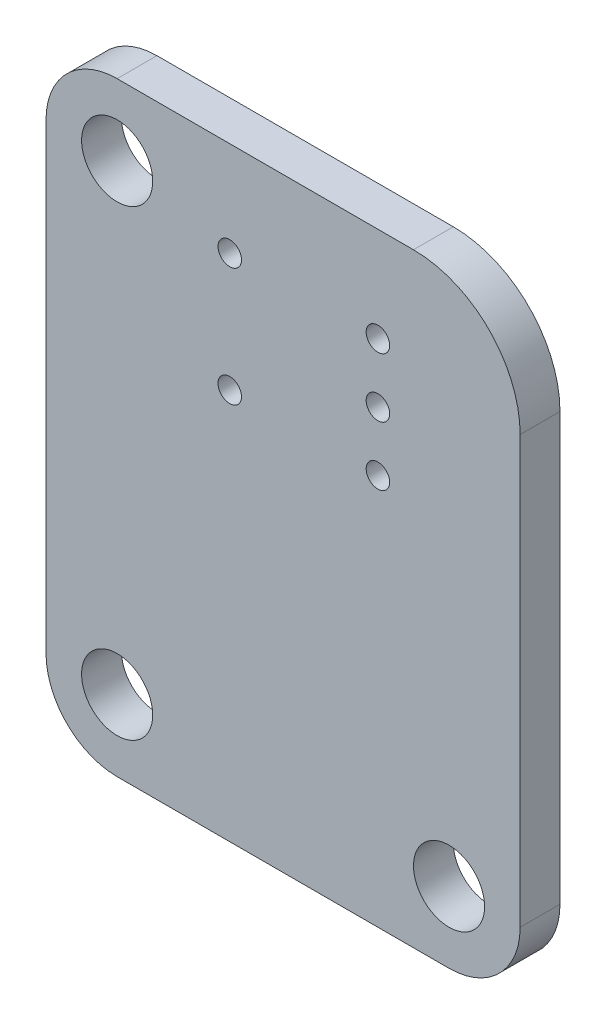
ISO-10303-21;
HEADER;
FILE_DESCRIPTION(('STEP AP214'),'2;1');
FILE_NAME('part.step','',(''),(''),'','','');
FILE_SCHEMA(('AUTOMOTIVE_DESIGN { 1 0 10303 214 1 1 1 1 }'));
ENDSEC;
DATA;
#1=APPLICATION_CONTEXT('core data for automotive mechanical design processes');
#2=APPLICATION_PROTOCOL_DEFINITION('international standard','automotive_design',2000,#1);
#3=PRODUCT_CONTEXT('',#1,'mechanical');
#4=PRODUCT('Part','Part','',(#3));
#5=PRODUCT_RELATED_PRODUCT_CATEGORY('part','',(#4));
#6=PRODUCT_DEFINITION_FORMATION('','',#4);
#7=PRODUCT_DEFINITION_CONTEXT('part definition',#1,'design');
#8=PRODUCT_DEFINITION('design','',#6,#7);
#9=PRODUCT_DEFINITION_SHAPE('','',#8);
#10=(LENGTH_UNIT() NAMED_UNIT(*) SI_UNIT(.MILLI.,.METRE.));
#11=(NAMED_UNIT(*) PLANE_ANGLE_UNIT() SI_UNIT($,.RADIAN.));
#12=(NAMED_UNIT(*) SI_UNIT($,.STERADIAN.) SOLID_ANGLE_UNIT());
#13=UNCERTAINTY_MEASURE_WITH_UNIT(LENGTH_MEASURE(1.E-05),#10,'distance_accuracy_value','');
#14=(GEOMETRIC_REPRESENTATION_CONTEXT(3) GLOBAL_UNCERTAINTY_ASSIGNED_CONTEXT((#13)) GLOBAL_UNIT_ASSIGNED_CONTEXT((#10,
#11,#12)) REPRESENTATION_CONTEXT('',''));
#15=CARTESIAN_POINT('',(0.,0.,0.));
#16=DIRECTION('',(0.,0.,1.));
#17=DIRECTION('',(1.,0.,0.));
#18=AXIS2_PLACEMENT_3D('',#15,#16,#17);
#19=CARTESIAN_POINT('',(95.5,60.5,-3.02000000000003));
#20=DIRECTION('',(0.,0.,-1.));
#21=DIRECTION('',(-1.,0.,0.));
#22=AXIS2_PLACEMENT_3D('',#19,#20,#21);
#23=CYLINDRICAL_SURFACE('',#22,4.50000000000003);
#24=CARTESIAN_POINT('',(95.5,60.5,-4.70000000000003));
#25=DIRECTION('',(0.,0.,1.));
#26=DIRECTION('',(1.,0.,0.));
#27=AXIS2_PLACEMENT_3D('',#24,#25,#26);
#28=CIRCLE('',#27,4.50000000000003);
#29=CARTESIAN_POINT('',(100.,60.5,-4.70000000000003));
#30=VERTEX_POINT('',#29);
#31=CARTESIAN_POINT('',(95.5,65.,-4.70000000000003));
#32=VERTEX_POINT('',#31);
#33=EDGE_CURVE('E129',#30,#32,#28,.T.);
#34=ORIENTED_EDGE('',*,*,#33,.T.);
#35=DIRECTION('',(0.,0.,-1.));
#36=VECTOR('',#35,1.);
#37=CARTESIAN_POINT('',(95.5,65.,-3.02000000000003));
#38=LINE('',#37,#36);
#39=CARTESIAN_POINT('',(95.5,65.,-3.02000000000003));
#40=VERTEX_POINT('',#39);
#41=EDGE_CURVE('E11',#40,#32,#38,.T.);
#42=ORIENTED_EDGE('',*,*,#41,.F.);
#43=CARTESIAN_POINT('',(95.5,60.5,-3.02000000000003));
#44=DIRECTION('',(0.,0.,1.));
#45=DIRECTION('',(1.,0.,0.));
#46=AXIS2_PLACEMENT_3D('',#43,#44,#45);
#47=CIRCLE('',#46,4.50000000000003);
#48=CARTESIAN_POINT('',(100.,60.5,-3.02000000000003));
#49=VERTEX_POINT('',#48);
#50=EDGE_CURVE('E144',#49,#40,#47,.T.);
#51=ORIENTED_EDGE('',*,*,#50,.F.);
#52=DIRECTION('',(0.,0.,-1.));
#53=VECTOR('',#52,1.);
#54=CARTESIAN_POINT('',(100.,60.5,-3.02000000000003));
#55=LINE('',#54,#53);
#56=EDGE_CURVE('E125',#49,#30,#55,.T.);
#57=ORIENTED_EDGE('',*,*,#56,.T.);
#58=EDGE_LOOP('',(#34,#42,#51,#57));
#59=FACE_BOUND('',#58,.T.);
#60=ADVANCED_FACE('F33',(#59),#23,.T.);
#61=CARTESIAN_POINT('',(95.5,65.,-3.02000000000003));
#62=DIRECTION('',(0.,-1.,0.));
#63=DIRECTION('',(1.,0.,0.));
#64=AXIS2_PLACEMENT_3D('',#61,#62,#63);
#65=PLANE('',#64);
#66=DIRECTION('',(-1.,0.,0.));
#67=VECTOR('',#66,1.);
#68=CARTESIAN_POINT('',(95.5,65.,-4.70000000000003));
#69=LINE('',#68,#67);
#70=CARTESIAN_POINT('',(83.,65.,-4.70000000000003));
#71=VERTEX_POINT('',#70);
#72=EDGE_CURVE('E132',#32,#71,#69,.T.);
#73=ORIENTED_EDGE('',*,*,#72,.T.);
#74=DIRECTION('',(0.,0.,-1.));
#75=VECTOR('',#74,1.);
#76=CARTESIAN_POINT('',(83.,65.,-3.02000000000003));
#77=LINE('',#76,#75);
#78=CARTESIAN_POINT('',(83.,65.,-3.02000000000003));
#79=VERTEX_POINT('',#78);
#80=EDGE_CURVE('E41',#79,#71,#77,.T.);
#81=ORIENTED_EDGE('',*,*,#80,.F.);
#82=DIRECTION('',(-1.,0.,0.));
#83=VECTOR('',#82,1.);
#84=CARTESIAN_POINT('',(95.5,65.,-3.02000000000003));
#85=LINE('',#84,#83);
#86=EDGE_CURVE('E92',#40,#79,#85,.T.);
#87=ORIENTED_EDGE('',*,*,#86,.F.);
#88=ORIENTED_EDGE('',*,*,#41,.T.);
#89=EDGE_LOOP('',(#73,#81,#87,#88));
#90=FACE_BOUND('',#89,.T.);
#91=ADVANCED_FACE('F239',(#90),#65,.F.);
#92=CARTESIAN_POINT('',(83.,62.,-3.02000000000003));
#93=DIRECTION('',(0.,0.,-1.));
#94=DIRECTION('',(-1.,0.,0.));
#95=AXIS2_PLACEMENT_3D('',#92,#93,#94);
#96=CYLINDRICAL_SURFACE('',#95,3.00000000000001);
#97=CARTESIAN_POINT('',(83.,62.,-4.70000000000003));
#98=DIRECTION('',(0.,0.,1.));
#99=DIRECTION('',(1.,0.,0.));
#100=AXIS2_PLACEMENT_3D('',#97,#98,#99);
#101=CIRCLE('',#100,3.00000000000001);
#102=CARTESIAN_POINT('',(80.,62.,-4.70000000000003));
#103=VERTEX_POINT('',#102);
#104=EDGE_CURVE('E135',#71,#103,#101,.T.);
#105=ORIENTED_EDGE('',*,*,#104,.T.);
#106=DIRECTION('',(0.,0.,-1.));
#107=VECTOR('',#106,1.);
#108=CARTESIAN_POINT('',(80.,62.,-3.02000000000003));
#109=LINE('',#108,#107);
#110=CARTESIAN_POINT('',(80.,62.,-3.02000000000003));
#111=VERTEX_POINT('',#110);
#112=EDGE_CURVE('E151',#111,#103,#109,.T.);
#113=ORIENTED_EDGE('',*,*,#112,.F.);
#114=CARTESIAN_POINT('',(83.,62.,-3.02000000000003));
#115=DIRECTION('',(0.,0.,1.));
#116=DIRECTION('',(1.,0.,0.));
#117=AXIS2_PLACEMENT_3D('',#114,#115,#116);
#118=CIRCLE('',#117,3.00000000000001);
#119=EDGE_CURVE('E159',#79,#111,#118,.T.);
#120=ORIENTED_EDGE('',*,*,#119,.F.);
#121=ORIENTED_EDGE('',*,*,#80,.T.);
#122=EDGE_LOOP('',(#105,#113,#120,#121));
#123=FACE_BOUND('',#122,.T.);
#124=ADVANCED_FACE('F157',(#123),#96,.T.);
#125=CARTESIAN_POINT('',(80.,42.5,-3.02000000000003));
#126=DIRECTION('',(1.,0.,0.));
#127=DIRECTION('',(0.,1.,0.));
#128=AXIS2_PLACEMENT_3D('',#125,#126,#127);
#129=PLANE('',#128);
#130=DIRECTION('',(0.,-1.,0.));
#131=VECTOR('',#130,1.);
#132=CARTESIAN_POINT('',(80.,42.5,-4.70000000000003));
#133=LINE('',#132,#131);
#134=CARTESIAN_POINT('',(80.,42.5,-4.70000000000003));
#135=VERTEX_POINT('',#134);
#136=EDGE_CURVE('E137',#103,#135,#133,.T.);
#137=ORIENTED_EDGE('',*,*,#136,.T.);
#138=DIRECTION('',(0.,0.,-1.));
#139=VECTOR('',#138,1.);
#140=CARTESIAN_POINT('',(80.,42.5,-3.02000000000003));
#141=LINE('',#140,#139);
#142=CARTESIAN_POINT('',(80.,42.5,-3.02000000000003));
#143=VERTEX_POINT('',#142);
#144=EDGE_CURVE('E148',#143,#135,#141,.T.);
#145=ORIENTED_EDGE('',*,*,#144,.F.);
#146=DIRECTION('',(0.,-1.,0.));
#147=VECTOR('',#146,1.);
#148=CARTESIAN_POINT('',(80.,42.5,-3.02000000000003));
#149=LINE('',#148,#147);
#150=EDGE_CURVE('E171',#111,#143,#149,.T.);
#151=ORIENTED_EDGE('',*,*,#150,.F.);
#152=ORIENTED_EDGE('',*,*,#112,.T.);
#153=EDGE_LOOP('',(#137,#145,#151,#152));
#154=FACE_BOUND('',#153,.T.);
#155=ADVANCED_FACE('F167',(#154),#129,.F.);
#156=CARTESIAN_POINT('',(83.,42.5,-3.02000000000003));
#157=DIRECTION('',(0.,0.,-1.));
#158=DIRECTION('',(-1.,0.,0.));
#159=AXIS2_PLACEMENT_3D('',#156,#157,#158);
#160=CYLINDRICAL_SURFACE('',#159,3.00000000000001);
#161=CARTESIAN_POINT('',(83.,42.5,-4.70000000000003));
#162=DIRECTION('',(0.,0.,1.));
#163=DIRECTION('',(-1.,0.,0.));
#164=AXIS2_PLACEMENT_3D('',#161,#162,#163);
#165=CIRCLE('',#164,3.00000000000001);
#166=CARTESIAN_POINT('',(83.,39.5,-4.70000000000003));
#167=VERTEX_POINT('',#166);
#168=EDGE_CURVE('E139',#135,#167,#165,.T.);
#169=ORIENTED_EDGE('',*,*,#168,.T.);
#170=DIRECTION('',(0.,0.,-1.));
#171=VECTOR('',#170,1.);
#172=CARTESIAN_POINT('',(83.,39.5,-3.02000000000003));
#173=LINE('',#172,#171);
#174=CARTESIAN_POINT('',(83.,39.5,-3.02000000000003));
#175=VERTEX_POINT('',#174);
#176=EDGE_CURVE('E120',#175,#167,#173,.T.);
#177=ORIENTED_EDGE('',*,*,#176,.F.);
#178=CARTESIAN_POINT('',(83.,42.5,-3.02000000000003));
#179=DIRECTION('',(0.,0.,1.));
#180=DIRECTION('',(-1.,0.,0.));
#181=AXIS2_PLACEMENT_3D('',#178,#179,#180);
#182=CIRCLE('',#181,3.00000000000001);
#183=EDGE_CURVE('E111',#143,#175,#182,.T.);
#184=ORIENTED_EDGE('',*,*,#183,.F.);
#185=ORIENTED_EDGE('',*,*,#144,.T.);
#186=EDGE_LOOP('',(#169,#177,#184,#185));
#187=FACE_BOUND('',#186,.T.);
#188=ADVANCED_FACE('F170',(#187),#160,.T.);
#189=CARTESIAN_POINT('',(97.,39.5,-3.02000000000003));
#190=DIRECTION('',(0.,1.,0.));
#191=DIRECTION('',(-1.,0.,0.));
#192=AXIS2_PLACEMENT_3D('',#189,#190,#191);
#193=PLANE('',#192);
#194=DIRECTION('',(1.,0.,0.));
#195=VECTOR('',#194,1.);
#196=CARTESIAN_POINT('',(97.,39.5,-4.70000000000003));
#197=LINE('',#196,#195);
#198=CARTESIAN_POINT('',(97.,39.5,-4.70000000000003));
#199=VERTEX_POINT('',#198);
#200=EDGE_CURVE('E119',#167,#199,#197,.T.);
#201=ORIENTED_EDGE('',*,*,#200,.T.);
#202=DIRECTION('',(0.,0.,-1.));
#203=VECTOR('',#202,1.);
#204=CARTESIAN_POINT('',(97.,39.5,-3.02000000000003));
#205=LINE('',#204,#203);
#206=CARTESIAN_POINT('',(97.,39.5,-3.02000000000003));
#207=VERTEX_POINT('',#206);
#208=EDGE_CURVE('E116',#207,#199,#205,.T.);
#209=ORIENTED_EDGE('',*,*,#208,.F.);
#210=DIRECTION('',(1.,0.,0.));
#211=VECTOR('',#210,1.);
#212=CARTESIAN_POINT('',(97.,39.5,-3.02000000000003));
#213=LINE('',#212,#211);
#214=EDGE_CURVE('E105',#175,#207,#213,.T.);
#215=ORIENTED_EDGE('',*,*,#214,.F.);
#216=ORIENTED_EDGE('',*,*,#176,.T.);
#217=EDGE_LOOP('',(#201,#209,#215,#216));
#218=FACE_BOUND('',#217,.T.);
#219=ADVANCED_FACE('F117',(#218),#193,.F.);
#220=CARTESIAN_POINT('',(97.,42.5,-3.02000000000003));
#221=DIRECTION('',(0.,0.,-1.));
#222=DIRECTION('',(-1.,0.,0.));
#223=AXIS2_PLACEMENT_3D('',#220,#221,#222);
#224=CYLINDRICAL_SURFACE('',#223,3.00000000000001);
#225=CARTESIAN_POINT('',(97.,42.5,-4.70000000000003));
#226=DIRECTION('',(0.,0.,1.));
#227=DIRECTION('',(1.,0.,0.));
#228=AXIS2_PLACEMENT_3D('',#225,#226,#227);
#229=CIRCLE('',#228,3.00000000000001);
#230=CARTESIAN_POINT('',(100.,42.5,-4.70000000000003));
#231=VERTEX_POINT('',#230);
#232=EDGE_CURVE('E78',#199,#231,#229,.T.);
#233=ORIENTED_EDGE('',*,*,#232,.T.);
#234=DIRECTION('',(0.,0.,-1.));
#235=VECTOR('',#234,1.);
#236=CARTESIAN_POINT('',(100.,42.5,-3.02000000000003));
#237=LINE('',#236,#235);
#238=CARTESIAN_POINT('',(100.,42.5,-3.02000000000003));
#239=VERTEX_POINT('',#238);
#240=EDGE_CURVE('E121',#239,#231,#237,.T.);
#241=ORIENTED_EDGE('',*,*,#240,.F.);
#242=CARTESIAN_POINT('',(97.,42.5,-3.02000000000003));
#243=DIRECTION('',(0.,0.,1.));
#244=DIRECTION('',(1.,0.,0.));
#245=AXIS2_PLACEMENT_3D('',#242,#243,#244);
#246=CIRCLE('',#245,3.00000000000001);
#247=EDGE_CURVE('E109',#207,#239,#246,.T.);
#248=ORIENTED_EDGE('',*,*,#247,.F.);
#249=ORIENTED_EDGE('',*,*,#208,.T.);
#250=EDGE_LOOP('',(#233,#241,#248,#249));
#251=FACE_BOUND('',#250,.T.);
#252=ADVANCED_FACE('F123',(#251),#224,.T.);
#253=CARTESIAN_POINT('',(100.,42.5,-3.02000000000003));
#254=DIRECTION('',(-1.,0.,0.));
#255=DIRECTION('',(0.,0.,1.));
#256=AXIS2_PLACEMENT_3D('',#253,#254,#255);
#257=PLANE('',#256);
#258=DIRECTION('',(0.,1.,0.));
#259=VECTOR('',#258,1.);
#260=CARTESIAN_POINT('',(100.,42.5,-4.70000000000003));
#261=LINE('',#260,#259);
#262=EDGE_CURVE('E84',#231,#30,#261,.T.);
#263=ORIENTED_EDGE('',*,*,#262,.T.);
#264=ORIENTED_EDGE('',*,*,#56,.F.);
#265=DIRECTION('',(0.,1.,0.));
#266=VECTOR('',#265,1.);
#267=CARTESIAN_POINT('',(100.,42.5,-3.02000000000003));
#268=LINE('',#267,#266);
#269=EDGE_CURVE('E49',#239,#49,#268,.T.);
#270=ORIENTED_EDGE('',*,*,#269,.F.);
#271=ORIENTED_EDGE('',*,*,#240,.T.);
#272=EDGE_LOOP('',(#263,#264,#270,#271));
#273=FACE_BOUND('',#272,.T.);
#274=ADVANCED_FACE('F246',(#273),#257,.F.);
#275=CARTESIAN_POINT('',(95.5,60.5,-3.02000000000003));
#276=DIRECTION('',(0.,0.,1.));
#277=DIRECTION('',(1.,0.,0.));
#278=AXIS2_PLACEMENT_3D('',#275,#276,#277);
#279=PLANE('',#278);
#280=CARTESIAN_POINT('',(94.0000000108,60.9999999962,-3.02000000000003));
#281=DIRECTION('',(0.,0.,1.));
#282=DIRECTION('',(1.,0.,0.));
#283=AXIS2_PLACEMENT_3D('',#280,#281,#282);
#284=CIRCLE('',#283,0.495300000000004);
#285=CARTESIAN_POINT('',(94.4953000108,60.9999999962,-3.02000000000003));
#286=VERTEX_POINT('',#285);
#287=EDGE_CURVE('E218',#286,#286,#284,.T.);
#288=ORIENTED_EDGE('',*,*,#287,.F.);
#289=EDGE_LOOP('',(#288));
#290=FACE_BOUND('',#289,.T.);
#291=CARTESIAN_POINT('',(94.0000000108,55.9999999886,-3.02000000000003));
#292=DIRECTION('',(0.,0.,1.));
#293=DIRECTION('',(1.,0.,0.));
#294=AXIS2_PLACEMENT_3D('',#291,#292,#293);
#295=CIRCLE('',#294,0.495300000000004);
#296=CARTESIAN_POINT('',(94.4953000108,55.9999999886,-3.02000000000003));
#297=VERTEX_POINT('',#296);
#298=EDGE_CURVE('E212',#297,#297,#295,.T.);
#299=ORIENTED_EDGE('',*,*,#298,.F.);
#300=EDGE_LOOP('',(#299));
#301=FACE_BOUND('',#300,.T.);
#302=CARTESIAN_POINT('',(94.0000000108,58.4999999924,-3.02000000000003));
#303=DIRECTION('',(0.,0.,1.));
#304=DIRECTION('',(1.,0.,0.));
#305=AXIS2_PLACEMENT_3D('',#302,#303,#304);
#306=CIRCLE('',#305,0.495300000000004);
#307=CARTESIAN_POINT('',(94.4953000108,58.4999999924,-3.02000000000003));
#308=VERTEX_POINT('',#307);
#309=EDGE_CURVE('E206',#308,#308,#306,.T.);
#310=ORIENTED_EDGE('',*,*,#309,.F.);
#311=EDGE_LOOP('',(#310));
#312=FACE_BOUND('',#311,.T.);
#313=CARTESIAN_POINT('',(87.7499999886,60.9999999962,-3.02000000000003));
#314=DIRECTION('',(0.,0.,1.));
#315=DIRECTION('',(1.,0.,0.));
#316=AXIS2_PLACEMENT_3D('',#313,#314,#315);
#317=CIRCLE('',#316,0.495300000000004);
#318=CARTESIAN_POINT('',(88.2452999886,60.9999999962,-3.02000000000003));
#319=VERTEX_POINT('',#318);
#320=EDGE_CURVE('E200',#319,#319,#317,.T.);
#321=ORIENTED_EDGE('',*,*,#320,.F.);
#322=EDGE_LOOP('',(#321));
#323=FACE_BOUND('',#322,.T.);
#324=CARTESIAN_POINT('',(87.7499999886,55.9999999886,-3.02000000000003));
#325=DIRECTION('',(0.,0.,1.));
#326=DIRECTION('',(1.,0.,0.));
#327=AXIS2_PLACEMENT_3D('',#324,#325,#326);
#328=CIRCLE('',#327,0.495300000000004);
#329=CARTESIAN_POINT('',(88.2452999886,55.9999999886,-3.02000000000003));
#330=VERTEX_POINT('',#329);
#331=EDGE_CURVE('E194',#330,#330,#328,.T.);
#332=ORIENTED_EDGE('',*,*,#331,.F.);
#333=EDGE_LOOP('',(#332));
#334=FACE_BOUND('',#333,.T.);
#335=CARTESIAN_POINT('',(83.,62.,-3.02000000000003));
#336=DIRECTION('',(0.,0.,1.));
#337=DIRECTION('',(1.,0.,0.));
#338=AXIS2_PLACEMENT_3D('',#335,#336,#337);
#339=CIRCLE('',#338,1.5);
#340=CARTESIAN_POINT('',(84.5,62.,-3.02000000000003));
#341=VERTEX_POINT('',#340);
#342=EDGE_CURVE('E188',#341,#341,#339,.T.);
#343=ORIENTED_EDGE('',*,*,#342,.F.);
#344=EDGE_LOOP('',(#343));
#345=FACE_BOUND('',#344,.T.);
#346=CARTESIAN_POINT('',(97.,42.5,-3.02000000000003));
#347=DIRECTION('',(0.,0.,1.));
#348=DIRECTION('',(1.,0.,0.));
#349=AXIS2_PLACEMENT_3D('',#346,#347,#348);
#350=CIRCLE('',#349,1.5);
#351=CARTESIAN_POINT('',(98.5,42.5,-3.02000000000003));
#352=VERTEX_POINT('',#351);
#353=EDGE_CURVE('E182',#352,#352,#350,.T.);
#354=ORIENTED_EDGE('',*,*,#353,.F.);
#355=EDGE_LOOP('',(#354));
#356=FACE_BOUND('',#355,.T.);
#357=CARTESIAN_POINT('',(83.,42.5,-3.02000000000003));
#358=DIRECTION('',(0.,0.,1.));
#359=DIRECTION('',(1.,0.,0.));
#360=AXIS2_PLACEMENT_3D('',#357,#358,#359);
#361=CIRCLE('',#360,1.5);
#362=CARTESIAN_POINT('',(84.5,42.5,-3.02000000000003));
#363=VERTEX_POINT('',#362);
#364=EDGE_CURVE('E133',#363,#363,#361,.T.);
#365=ORIENTED_EDGE('',*,*,#364,.F.);
#366=EDGE_LOOP('',(#365));
#367=FACE_BOUND('',#366,.T.);
#368=ORIENTED_EDGE('',*,*,#50,.T.);
#369=ORIENTED_EDGE('',*,*,#86,.T.);
#370=ORIENTED_EDGE('',*,*,#119,.T.);
#371=ORIENTED_EDGE('',*,*,#150,.T.);
#372=ORIENTED_EDGE('',*,*,#183,.T.);
#373=ORIENTED_EDGE('',*,*,#214,.T.);
#374=ORIENTED_EDGE('',*,*,#247,.T.);
#375=ORIENTED_EDGE('',*,*,#269,.T.);
#376=EDGE_LOOP('',(#368,#369,#370,#371,#372,#373,#374,#375));
#377=FACE_BOUND('',#376,.T.);
#378=ADVANCED_FACE('F107',(#290,#301,#312,#323,#334,#345,#356,#367,#377),#279,.T.);
#379=CARTESIAN_POINT('',(95.5,60.5,-4.70000000000003));
#380=DIRECTION('',(0.,0.,1.));
#381=DIRECTION('',(1.,0.,0.));
#382=AXIS2_PLACEMENT_3D('',#379,#380,#381);
#383=PLANE('',#382);
#384=CARTESIAN_POINT('',(94.0000000108,60.9999999962,-4.70000000000003));
#385=DIRECTION('',(0.,0.,1.));
#386=DIRECTION('',(1.,0.,0.));
#387=AXIS2_PLACEMENT_3D('',#384,#385,#386);
#388=CIRCLE('',#387,0.495300000000004);
#389=CARTESIAN_POINT('',(94.4953000108,60.9999999962,-4.70000000000003));
#390=VERTEX_POINT('',#389);
#391=EDGE_CURVE('E221',#390,#390,#388,.T.);
#392=ORIENTED_EDGE('',*,*,#391,.T.);
#393=EDGE_LOOP('',(#392));
#394=FACE_BOUND('',#393,.T.);
#395=CARTESIAN_POINT('',(94.0000000108,55.9999999886,-4.70000000000003));
#396=DIRECTION('',(0.,0.,1.));
#397=DIRECTION('',(1.,0.,0.));
#398=AXIS2_PLACEMENT_3D('',#395,#396,#397);
#399=CIRCLE('',#398,0.495300000000004);
#400=CARTESIAN_POINT('',(94.4953000108,55.9999999886,-4.70000000000003));
#401=VERTEX_POINT('',#400);
#402=EDGE_CURVE('E215',#401,#401,#399,.T.);
#403=ORIENTED_EDGE('',*,*,#402,.T.);
#404=EDGE_LOOP('',(#403));
#405=FACE_BOUND('',#404,.T.);
#406=CARTESIAN_POINT('',(94.0000000108,58.4999999924,-4.70000000000003));
#407=DIRECTION('',(0.,0.,1.));
#408=DIRECTION('',(1.,0.,0.));
#409=AXIS2_PLACEMENT_3D('',#406,#407,#408);
#410=CIRCLE('',#409,0.495300000000004);
#411=CARTESIAN_POINT('',(94.4953000108,58.4999999924,-4.70000000000003));
#412=VERTEX_POINT('',#411);
#413=EDGE_CURVE('E209',#412,#412,#410,.T.);
#414=ORIENTED_EDGE('',*,*,#413,.T.);
#415=EDGE_LOOP('',(#414));
#416=FACE_BOUND('',#415,.T.);
#417=CARTESIAN_POINT('',(87.7499999886,60.9999999962,-4.70000000000003));
#418=DIRECTION('',(0.,0.,1.));
#419=DIRECTION('',(1.,0.,0.));
#420=AXIS2_PLACEMENT_3D('',#417,#418,#419);
#421=CIRCLE('',#420,0.495300000000004);
#422=CARTESIAN_POINT('',(88.2452999886,60.9999999962,-4.70000000000003));
#423=VERTEX_POINT('',#422);
#424=EDGE_CURVE('E203',#423,#423,#421,.T.);
#425=ORIENTED_EDGE('',*,*,#424,.T.);
#426=EDGE_LOOP('',(#425));
#427=FACE_BOUND('',#426,.T.);
#428=CARTESIAN_POINT('',(87.7499999886,55.9999999886,-4.70000000000003));
#429=DIRECTION('',(0.,0.,1.));
#430=DIRECTION('',(1.,0.,0.));
#431=AXIS2_PLACEMENT_3D('',#428,#429,#430);
#432=CIRCLE('',#431,0.495300000000004);
#433=CARTESIAN_POINT('',(88.2452999886,55.9999999886,-4.70000000000003));
#434=VERTEX_POINT('',#433);
#435=EDGE_CURVE('E197',#434,#434,#432,.T.);
#436=ORIENTED_EDGE('',*,*,#435,.T.);
#437=EDGE_LOOP('',(#436));
#438=FACE_BOUND('',#437,.T.);
#439=CARTESIAN_POINT('',(83.,62.,-4.70000000000003));
#440=DIRECTION('',(0.,0.,1.));
#441=DIRECTION('',(1.,0.,0.));
#442=AXIS2_PLACEMENT_3D('',#439,#440,#441);
#443=CIRCLE('',#442,1.5);
#444=CARTESIAN_POINT('',(84.5,62.,-4.70000000000003));
#445=VERTEX_POINT('',#444);
#446=EDGE_CURVE('E191',#445,#445,#443,.T.);
#447=ORIENTED_EDGE('',*,*,#446,.T.);
#448=EDGE_LOOP('',(#447));
#449=FACE_BOUND('',#448,.T.);
#450=CARTESIAN_POINT('',(97.,42.5,-4.70000000000003));
#451=DIRECTION('',(0.,0.,1.));
#452=DIRECTION('',(1.,0.,0.));
#453=AXIS2_PLACEMENT_3D('',#450,#451,#452);
#454=CIRCLE('',#453,1.5);
#455=CARTESIAN_POINT('',(98.5,42.5,-4.70000000000003));
#456=VERTEX_POINT('',#455);
#457=EDGE_CURVE('E185',#456,#456,#454,.T.);
#458=ORIENTED_EDGE('',*,*,#457,.T.);
#459=EDGE_LOOP('',(#458));
#460=FACE_BOUND('',#459,.T.);
#461=CARTESIAN_POINT('',(83.,42.5,-4.70000000000003));
#462=DIRECTION('',(0.,0.,1.));
#463=DIRECTION('',(1.,0.,0.));
#464=AXIS2_PLACEMENT_3D('',#461,#462,#463);
#465=CIRCLE('',#464,1.5);
#466=CARTESIAN_POINT('',(84.5,42.5,-4.70000000000003));
#467=VERTEX_POINT('',#466);
#468=EDGE_CURVE('E179',#467,#467,#465,.T.);
#469=ORIENTED_EDGE('',*,*,#468,.T.);
#470=EDGE_LOOP('',(#469));
#471=FACE_BOUND('',#470,.T.);
#472=ORIENTED_EDGE('',*,*,#33,.F.);
#473=ORIENTED_EDGE('',*,*,#262,.F.);
#474=ORIENTED_EDGE('',*,*,#232,.F.);
#475=ORIENTED_EDGE('',*,*,#200,.F.);
#476=ORIENTED_EDGE('',*,*,#168,.F.);
#477=ORIENTED_EDGE('',*,*,#136,.F.);
#478=ORIENTED_EDGE('',*,*,#104,.F.);
#479=ORIENTED_EDGE('',*,*,#72,.F.);
#480=EDGE_LOOP('',(#472,#473,#474,#475,#476,#477,#478,#479));
#481=FACE_BOUND('',#480,.T.);
#482=ADVANCED_FACE('F163',(#394,#405,#416,#427,#438,#449,#460,#471,#481),#383,.F.);
#483=CARTESIAN_POINT('',(83.,42.5,-4.70000000000003));
#484=DIRECTION('',(0.,0.,1.));
#485=DIRECTION('',(1.,0.,0.));
#486=AXIS2_PLACEMENT_3D('',#483,#484,#485);
#487=CYLINDRICAL_SURFACE('',#486,1.5);
#488=ORIENTED_EDGE('',*,*,#364,.T.);
#489=EDGE_LOOP('',(#488));
#490=FACE_BOUND('',#489,.T.);
#491=ORIENTED_EDGE('',*,*,#468,.F.);
#492=EDGE_LOOP('',(#491));
#493=FACE_BOUND('',#492,.T.);
#494=ADVANCED_FACE('F304',(#490,#493),#487,.F.);
#495=CARTESIAN_POINT('',(97.,42.5,-4.70000000000003));
#496=DIRECTION('',(0.,0.,1.));
#497=DIRECTION('',(1.,0.,0.));
#498=AXIS2_PLACEMENT_3D('',#495,#496,#497);
#499=CYLINDRICAL_SURFACE('',#498,1.5);
#500=ORIENTED_EDGE('',*,*,#353,.T.);
#501=EDGE_LOOP('',(#500));
#502=FACE_BOUND('',#501,.T.);
#503=ORIENTED_EDGE('',*,*,#457,.F.);
#504=EDGE_LOOP('',(#503));
#505=FACE_BOUND('',#504,.T.);
#506=ADVANCED_FACE('F312',(#502,#505),#499,.F.);
#507=CARTESIAN_POINT('',(83.,62.,-4.70000000000003));
#508=DIRECTION('',(0.,0.,1.));
#509=DIRECTION('',(1.,0.,0.));
#510=AXIS2_PLACEMENT_3D('',#507,#508,#509);
#511=CYLINDRICAL_SURFACE('',#510,1.5);
#512=ORIENTED_EDGE('',*,*,#342,.T.);
#513=EDGE_LOOP('',(#512));
#514=FACE_BOUND('',#513,.T.);
#515=ORIENTED_EDGE('',*,*,#446,.F.);
#516=EDGE_LOOP('',(#515));
#517=FACE_BOUND('',#516,.T.);
#518=ADVANCED_FACE('F322',(#514,#517),#511,.F.);
#519=CARTESIAN_POINT('',(87.7499999886,55.9999999886,-4.70000000000003));
#520=DIRECTION('',(0.,0.,1.));
#521=DIRECTION('',(1.,0.,0.));
#522=AXIS2_PLACEMENT_3D('',#519,#520,#521);
#523=CYLINDRICAL_SURFACE('',#522,0.495300000000004);
#524=ORIENTED_EDGE('',*,*,#331,.T.);
#525=EDGE_LOOP('',(#524));
#526=FACE_BOUND('',#525,.T.);
#527=ORIENTED_EDGE('',*,*,#435,.F.);
#528=EDGE_LOOP('',(#527));
#529=FACE_BOUND('',#528,.T.);
#530=ADVANCED_FACE('F332',(#526,#529),#523,.F.);
#531=CARTESIAN_POINT('',(87.7499999886,60.9999999962,-4.70000000000003));
#532=DIRECTION('',(0.,0.,1.));
#533=DIRECTION('',(1.,0.,0.));
#534=AXIS2_PLACEMENT_3D('',#531,#532,#533);
#535=CYLINDRICAL_SURFACE('',#534,0.495300000000004);
#536=ORIENTED_EDGE('',*,*,#320,.T.);
#537=EDGE_LOOP('',(#536));
#538=FACE_BOUND('',#537,.T.);
#539=ORIENTED_EDGE('',*,*,#424,.F.);
#540=EDGE_LOOP('',(#539));
#541=FACE_BOUND('',#540,.T.);
#542=ADVANCED_FACE('F342',(#538,#541),#535,.F.);
#543=CARTESIAN_POINT('',(94.0000000108,58.4999999924,-4.70000000000003));
#544=DIRECTION('',(0.,0.,1.));
#545=DIRECTION('',(1.,0.,0.));
#546=AXIS2_PLACEMENT_3D('',#543,#544,#545);
#547=CYLINDRICAL_SURFACE('',#546,0.495300000000004);
#548=ORIENTED_EDGE('',*,*,#309,.T.);
#549=EDGE_LOOP('',(#548));
#550=FACE_BOUND('',#549,.T.);
#551=ORIENTED_EDGE('',*,*,#413,.F.);
#552=EDGE_LOOP('',(#551));
#553=FACE_BOUND('',#552,.T.);
#554=ADVANCED_FACE('F235',(#550,#553),#547,.F.);
#555=CARTESIAN_POINT('',(94.0000000108,55.9999999886,-4.70000000000003));
#556=DIRECTION('',(0.,0.,1.));
#557=DIRECTION('',(1.,0.,0.));
#558=AXIS2_PLACEMENT_3D('',#555,#556,#557);
#559=CYLINDRICAL_SURFACE('',#558,0.495300000000004);
#560=ORIENTED_EDGE('',*,*,#298,.T.);
#561=EDGE_LOOP('',(#560));
#562=FACE_BOUND('',#561,.T.);
#563=ORIENTED_EDGE('',*,*,#402,.F.);
#564=EDGE_LOOP('',(#563));
#565=FACE_BOUND('',#564,.T.);
#566=ADVANCED_FACE('F229',(#562,#565),#559,.F.);
#567=CARTESIAN_POINT('',(94.0000000108,60.9999999962,-4.70000000000003));
#568=DIRECTION('',(0.,0.,1.));
#569=DIRECTION('',(1.,0.,0.));
#570=AXIS2_PLACEMENT_3D('',#567,#568,#569);
#571=CYLINDRICAL_SURFACE('',#570,0.495300000000004);
#572=ORIENTED_EDGE('',*,*,#287,.T.);
#573=EDGE_LOOP('',(#572));
#574=FACE_BOUND('',#573,.T.);
#575=ORIENTED_EDGE('',*,*,#391,.F.);
#576=EDGE_LOOP('',(#575));
#577=FACE_BOUND('',#576,.T.);
#578=ADVANCED_FACE('F227',(#574,#577),#571,.F.);
#579=CLOSED_SHELL('',(#60,#91,#124,#155,#188,#219,#252,#274,#378,#482,#494,#506,#518,#530,#542,
#554,#566,#578));
#580=MANIFOLD_SOLID_BREP('B2',#579);
#581=ADVANCED_BREP_SHAPE_REPRESENTATION('',(#18,#580),#14);
#582=SHAPE_DEFINITION_REPRESENTATION(#9,#581);
ENDSEC;
END-ISO-10303-21;
